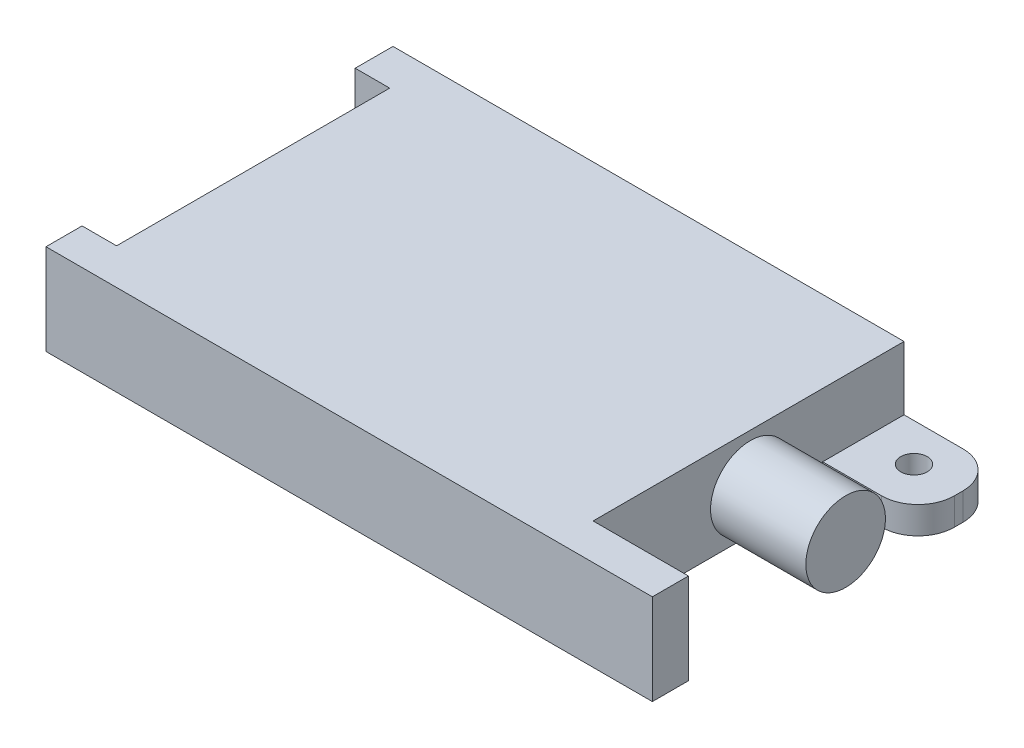
ISO-10303-21;
HEADER;
FILE_DESCRIPTION(('STEP AP214'),'2;1');
FILE_NAME('part.step','',(''),(''),'','','');
FILE_SCHEMA(('AUTOMOTIVE_DESIGN { 1 0 10303 214 1 1 1 1 }'));
ENDSEC;
DATA;
#1=APPLICATION_CONTEXT('core data for automotive mechanical design processes');
#2=APPLICATION_PROTOCOL_DEFINITION('international standard','automotive_design',2000,#1);
#3=PRODUCT_CONTEXT('',#1,'mechanical');
#4=PRODUCT('Part','Part','',(#3));
#5=PRODUCT_RELATED_PRODUCT_CATEGORY('part','',(#4));
#6=PRODUCT_DEFINITION_FORMATION('','',#4);
#7=PRODUCT_DEFINITION_CONTEXT('part definition',#1,'design');
#8=PRODUCT_DEFINITION('design','',#6,#7);
#9=PRODUCT_DEFINITION_SHAPE('','',#8);
#10=(LENGTH_UNIT() NAMED_UNIT(*) SI_UNIT(.MILLI.,.METRE.));
#11=(NAMED_UNIT(*) PLANE_ANGLE_UNIT() SI_UNIT($,.RADIAN.));
#12=(NAMED_UNIT(*) SI_UNIT($,.STERADIAN.) SOLID_ANGLE_UNIT());
#13=UNCERTAINTY_MEASURE_WITH_UNIT(LENGTH_MEASURE(1.E-05),#10,'distance_accuracy_value','');
#14=(GEOMETRIC_REPRESENTATION_CONTEXT(3) GLOBAL_UNCERTAINTY_ASSIGNED_CONTEXT((#13)) GLOBAL_UNIT_ASSIGNED_CONTEXT((#10,
#11,#12)) REPRESENTATION_CONTEXT('',''));
#15=CARTESIAN_POINT('',(0.,0.,0.));
#16=DIRECTION('',(0.,0.,1.));
#17=DIRECTION('',(1.,0.,0.));
#18=AXIS2_PLACEMENT_3D('',#15,#16,#17);
#19=CARTESIAN_POINT('',(51.4823576870266,20.,24.9824069411109));
#20=DIRECTION('',(-1.,0.,0.));
#21=DIRECTION('',(0.,0.,1.));
#22=AXIS2_PLACEMENT_3D('',#19,#20,#21);
#23=PLANE('',#22);
#24=DIRECTION('',(0.,-1.,0.));
#25=VECTOR('',#24,1.);
#26=CARTESIAN_POINT('',(51.4823576870266,20.,-43.5299514882993));
#27=LINE('',#26,#25);
#28=CARTESIAN_POINT('',(51.4823576870266,20.,-43.5299514882993));
#29=VERTEX_POINT('',#28);
#30=CARTESIAN_POINT('',(51.4823576870266,6.00000000000001,-43.5299514882993));
#31=VERTEX_POINT('',#30);
#32=EDGE_CURVE('E155',#29,#31,#27,.T.);
#33=ORIENTED_EDGE('',*,*,#32,.F.);
#34=DIRECTION('',(0.,0.,-1.));
#35=VECTOR('',#34,1.);
#36=CARTESIAN_POINT('',(51.4823576870266,20.,24.9824069411109));
#37=LINE('',#36,#35);
#38=CARTESIAN_POINT('',(51.4823576870266,20.,24.9824069411109));
#39=VERTEX_POINT('',#38);
#40=EDGE_CURVE('E141',#39,#29,#37,.T.);
#41=ORIENTED_EDGE('',*,*,#40,.F.);
#42=DIRECTION('',(0.,-1.,0.));
#43=VECTOR('',#42,1.);
#44=CARTESIAN_POINT('',(51.4823576870266,20.,24.9824069411109));
#45=LINE('',#44,#43);
#46=CARTESIAN_POINT('',(51.4823576870266,0.,24.9824069411109));
#47=VERTEX_POINT('',#46);
#48=EDGE_CURVE('E221',#39,#47,#45,.T.);
#49=ORIENTED_EDGE('',*,*,#48,.T.);
#50=DIRECTION('',(0.,0.,-1.));
#51=VECTOR('',#50,1.);
#52=CARTESIAN_POINT('',(51.4823576870266,0.,24.9824069411109));
#53=LINE('',#52,#51);
#54=CARTESIAN_POINT('',(51.4823576870266,0.,-25.6007158770618));
#55=VERTEX_POINT('',#54);
#56=EDGE_CURVE('E188',#47,#55,#53,.T.);
#57=ORIENTED_EDGE('',*,*,#56,.T.);
#58=DIRECTION('',(0.,-1.,0.));
#59=VECTOR('',#58,1.);
#60=CARTESIAN_POINT('',(51.4823576870266,20.,-25.6007158770618));
#61=LINE('',#60,#59);
#62=CARTESIAN_POINT('',(51.4823576870266,6.00000000000001,-25.6007158770618));
#63=VERTEX_POINT('',#62);
#64=EDGE_CURVE('E219',#63,#55,#61,.T.);
#65=ORIENTED_EDGE('',*,*,#64,.F.);
#66=DIRECTION('',(0.,0.,1.));
#67=VECTOR('',#66,1.);
#68=CARTESIAN_POINT('',(51.4823576870266,6.00000000000001,-21.0327198768425));
#69=LINE('',#68,#67);
#70=EDGE_CURVE('E158',#31,#63,#69,.T.);
#71=ORIENTED_EDGE('',*,*,#70,.F.);
#72=EDGE_LOOP('',(#33,#41,#49,#57,#65,#71));
#73=FACE_BOUND('',#72,.T.);
#74=CARTESIAN_POINT('',(51.4823576870266,9.24397515251485,-9.65602726427051));
#75=DIRECTION('',(-1.,0.,0.));
#76=DIRECTION('',(0.,0.,1.));
#77=AXIS2_PLACEMENT_3D('',#74,#75,#76);
#78=CIRCLE('',#77,8.76812544066752);
#79=CARTESIAN_POINT('',(51.4823576870266,9.24397515251485,-0.887901823602988));
#80=VERTEX_POINT('',#79);
#81=EDGE_CURVE('E11',#80,#80,#78,.F.);
#82=ORIENTED_EDGE('',*,*,#81,.F.);
#83=EDGE_LOOP('',(#82));
#84=FACE_BOUND('',#83,.T.);
#85=ADVANCED_FACE('F33',(#73,#84),#23,.F.);
#86=CARTESIAN_POINT('',(-61.1311927422638,20.,24.9824069411109));
#87=DIRECTION('',(1.,0.,0.));
#88=DIRECTION('',(0.,0.,-1.));
#89=AXIS2_PLACEMENT_3D('',#86,#87,#88);
#90=PLANE('',#89);
#91=DIRECTION('',(0.,0.,1.));
#92=VECTOR('',#91,1.);
#93=CARTESIAN_POINT('',(-61.1311927422638,0.,24.9824069411109));
#94=LINE('',#93,#92);
#95=CARTESIAN_POINT('',(-61.1311927422638,0.,24.9824069411109));
#96=VERTEX_POINT('',#95);
#97=CARTESIAN_POINT('',(-61.1311927422638,0.,32.9313546041917));
#98=VERTEX_POINT('',#97);
#99=EDGE_CURVE('E161',#96,#98,#94,.T.);
#100=ORIENTED_EDGE('',*,*,#99,.T.);
#101=DIRECTION('',(0.,-1.,0.));
#102=VECTOR('',#101,1.);
#103=CARTESIAN_POINT('',(-61.1311927422638,20.,32.9313546041917));
#104=LINE('',#103,#102);
#105=CARTESIAN_POINT('',(-61.1311927422638,20.,32.9313546041917));
#106=VERTEX_POINT('',#105);
#107=EDGE_CURVE('E229',#106,#98,#104,.T.);
#108=ORIENTED_EDGE('',*,*,#107,.F.);
#109=DIRECTION('',(0.,0.,1.));
#110=VECTOR('',#109,1.);
#111=CARTESIAN_POINT('',(-61.1311927422638,20.,24.9824069411109));
#112=LINE('',#111,#110);
#113=CARTESIAN_POINT('',(-61.1311927422638,20.,24.9824069411109));
#114=VERTEX_POINT('',#113);
#115=EDGE_CURVE('E206',#114,#106,#112,.T.);
#116=ORIENTED_EDGE('',*,*,#115,.F.);
#117=DIRECTION('',(0.,-1.,0.));
#118=VECTOR('',#117,1.);
#119=CARTESIAN_POINT('',(-61.1311927422638,20.,24.9824069411109));
#120=LINE('',#119,#118);
#121=EDGE_CURVE('E179',#114,#96,#120,.T.);
#122=ORIENTED_EDGE('',*,*,#121,.T.);
#123=EDGE_LOOP('',(#100,#108,#116,#122));
#124=FACE_BOUND('',#123,.T.);
#125=ADVANCED_FACE('F293',(#124),#90,.F.);
#126=CARTESIAN_POINT('',(-61.1311927422638,20.,32.9313546041917));
#127=DIRECTION('',(0.,0.,-1.));
#128=DIRECTION('',(-1.,0.,0.));
#129=AXIS2_PLACEMENT_3D('',#126,#127,#128);
#130=PLANE('',#129);
#131=DIRECTION('',(1.,0.,0.));
#132=VECTOR('',#131,1.);
#133=CARTESIAN_POINT('',(-61.1311927422638,0.,32.9313546041917));
#134=LINE('',#133,#132);
#135=CARTESIAN_POINT('',(72.4868322609506,0.,32.9313546041917));
#136=VERTEX_POINT('',#135);
#137=EDGE_CURVE('E182',#98,#136,#134,.T.);
#138=ORIENTED_EDGE('',*,*,#137,.T.);
#139=DIRECTION('',(0.,-1.,0.));
#140=VECTOR('',#139,1.);
#141=CARTESIAN_POINT('',(72.4868322609506,20.,32.9313546041917));
#142=LINE('',#141,#140);
#143=CARTESIAN_POINT('',(72.4868322609506,20.,32.9313546041917));
#144=VERTEX_POINT('',#143);
#145=EDGE_CURVE('E226',#144,#136,#142,.T.);
#146=ORIENTED_EDGE('',*,*,#145,.F.);
#147=DIRECTION('',(1.,0.,0.));
#148=VECTOR('',#147,1.);
#149=CARTESIAN_POINT('',(-61.1311927422638,20.,32.9313546041917));
#150=LINE('',#149,#148);
#151=EDGE_CURVE('E268',#106,#144,#150,.T.);
#152=ORIENTED_EDGE('',*,*,#151,.F.);
#153=ORIENTED_EDGE('',*,*,#107,.T.);
#154=EDGE_LOOP('',(#138,#146,#152,#153));
#155=FACE_BOUND('',#154,.T.);
#156=ADVANCED_FACE('F297',(#155),#130,.F.);
#157=CARTESIAN_POINT('',(72.4868322609506,20.,32.9313546041917));
#158=DIRECTION('',(-1.,0.,0.));
#159=DIRECTION('',(0.,0.,1.));
#160=AXIS2_PLACEMENT_3D('',#157,#158,#159);
#161=PLANE('',#160);
#162=DIRECTION('',(0.,0.,-1.));
#163=VECTOR('',#162,1.);
#164=CARTESIAN_POINT('',(72.4868322609506,0.,32.9313546041917));
#165=LINE('',#164,#163);
#166=CARTESIAN_POINT('',(72.4868322609506,0.,24.9824069411109));
#167=VERTEX_POINT('',#166);
#168=EDGE_CURVE('E184',#136,#167,#165,.T.);
#169=ORIENTED_EDGE('',*,*,#168,.T.);
#170=DIRECTION('',(0.,-1.,0.));
#171=VECTOR('',#170,1.);
#172=CARTESIAN_POINT('',(72.4868322609506,20.,24.9824069411109));
#173=LINE('',#172,#171);
#174=CARTESIAN_POINT('',(72.4868322609506,20.,24.9824069411109));
#175=VERTEX_POINT('',#174);
#176=EDGE_CURVE('E223',#175,#167,#173,.T.);
#177=ORIENTED_EDGE('',*,*,#176,.F.);
#178=DIRECTION('',(0.,0.,-1.));
#179=VECTOR('',#178,1.);
#180=CARTESIAN_POINT('',(72.4868322609506,20.,32.9313546041917));
#181=LINE('',#180,#179);
#182=EDGE_CURVE('E270',#144,#175,#181,.T.);
#183=ORIENTED_EDGE('',*,*,#182,.F.);
#184=ORIENTED_EDGE('',*,*,#145,.T.);
#185=EDGE_LOOP('',(#169,#177,#183,#184));
#186=FACE_BOUND('',#185,.T.);
#187=ADVANCED_FACE('F275',(#186),#161,.F.);
#188=CARTESIAN_POINT('',(72.4868322609506,20.,24.9824069411109));
#189=DIRECTION('',(0.,0.,1.));
#190=DIRECTION('',(1.,0.,0.));
#191=AXIS2_PLACEMENT_3D('',#188,#189,#190);
#192=PLANE('',#191);
#193=DIRECTION('',(-1.,0.,0.));
#194=VECTOR('',#193,1.);
#195=CARTESIAN_POINT('',(72.4868322609506,0.,24.9824069411109));
#196=LINE('',#195,#194);
#197=EDGE_CURVE('E186',#167,#47,#196,.T.);
#198=ORIENTED_EDGE('',*,*,#197,.T.);
#199=ORIENTED_EDGE('',*,*,#48,.F.);
#200=DIRECTION('',(-1.,0.,0.));
#201=VECTOR('',#200,1.);
#202=CARTESIAN_POINT('',(72.4868322609506,20.,24.9824069411109));
#203=LINE('',#202,#201);
#204=EDGE_CURVE('E148',#175,#39,#203,.T.);
#205=ORIENTED_EDGE('',*,*,#204,.F.);
#206=ORIENTED_EDGE('',*,*,#176,.T.);
#207=EDGE_LOOP('',(#198,#199,#205,#206));
#208=FACE_BOUND('',#207,.T.);
#209=ADVANCED_FACE('F279',(#208),#192,.F.);
#210=CARTESIAN_POINT('',(51.4823576870266,20.,-25.6007158770618));
#211=DIRECTION('',(0.,0.,-1.));
#212=DIRECTION('',(-1.,0.,0.));
#213=AXIS2_PLACEMENT_3D('',#210,#211,#212);
#214=PLANE('',#213);
#215=DIRECTION('',(0.,-1.,0.));
#216=VECTOR('',#215,1.);
#217=CARTESIAN_POINT('',(64.4868322609506,20.,-25.6007158770618));
#218=LINE('',#217,#216);
#219=CARTESIAN_POINT('',(64.4868322609506,0.,-25.6007158770618));
#220=VERTEX_POINT('',#219);
#221=CARTESIAN_POINT('',(64.4868322609506,6.00000000000001,-25.6007158770618));
#222=VERTEX_POINT('',#221);
#223=EDGE_CURVE('E242',#220,#222,#218,.F.);
#224=ORIENTED_EDGE('',*,*,#223,.T.);
#225=DIRECTION('',(-1.,0.,0.));
#226=VECTOR('',#225,1.);
#227=CARTESIAN_POINT('',(51.4823576870266,6.00000000000001,-25.6007158770618));
#228=LINE('',#227,#226);
#229=EDGE_CURVE('E48',#222,#63,#228,.T.);
#230=ORIENTED_EDGE('',*,*,#229,.T.);
#231=ORIENTED_EDGE('',*,*,#64,.T.);
#232=DIRECTION('',(1.,0.,0.));
#233=VECTOR('',#232,1.);
#234=CARTESIAN_POINT('',(51.4823576870266,0.,-25.6007158770618));
#235=LINE('',#234,#233);
#236=EDGE_CURVE('E191',#55,#220,#235,.T.);
#237=ORIENTED_EDGE('',*,*,#236,.T.);
#238=EDGE_LOOP('',(#224,#230,#231,#237));
#239=FACE_BOUND('',#238,.T.);
#240=ADVANCED_FACE('F282',(#239),#214,.F.);
#241=CARTESIAN_POINT('',(72.4868322609506,20.,-25.6007158770618));
#242=DIRECTION('',(-1.,0.,0.));
#243=DIRECTION('',(0.,0.,1.));
#244=AXIS2_PLACEMENT_3D('',#241,#242,#243);
#245=PLANE('',#244);
#246=DIRECTION('',(0.,-1.,0.));
#247=VECTOR('',#246,1.);
#248=CARTESIAN_POINT('',(72.4868322609506,20.,-35.5299514882993));
#249=LINE('',#248,#247);
#250=CARTESIAN_POINT('',(72.4868322609506,0.,-35.5299514882993));
#251=VERTEX_POINT('',#250);
#252=CARTESIAN_POINT('',(72.4868322609506,6.00000000000001,-35.5299514882993));
#253=VERTEX_POINT('',#252);
#254=EDGE_CURVE('E239',#251,#253,#249,.F.);
#255=ORIENTED_EDGE('',*,*,#254,.T.);
#256=DIRECTION('',(0.,0.,1.));
#257=VECTOR('',#256,1.);
#258=CARTESIAN_POINT('',(72.4868322609506,6.00000000000001,-25.6007158770618));
#259=LINE('',#258,#257);
#260=CARTESIAN_POINT('',(72.4868322609506,6.00000000000001,-33.6007158770619));
#261=VERTEX_POINT('',#260);
#262=EDGE_CURVE('E246',#253,#261,#259,.T.);
#263=ORIENTED_EDGE('',*,*,#262,.T.);
#264=DIRECTION('',(0.,-1.,0.));
#265=VECTOR('',#264,1.);
#266=CARTESIAN_POINT('',(72.4868322609506,20.,-33.6007158770619));
#267=LINE('',#266,#265);
#268=CARTESIAN_POINT('',(72.4868322609506,0.,-33.6007158770619));
#269=VERTEX_POINT('',#268);
#270=EDGE_CURVE('E237',#261,#269,#267,.T.);
#271=ORIENTED_EDGE('',*,*,#270,.T.);
#272=DIRECTION('',(0.,0.,-1.));
#273=VECTOR('',#272,1.);
#274=CARTESIAN_POINT('',(72.4868322609506,0.,-25.6007158770618));
#275=LINE('',#274,#273);
#276=EDGE_CURVE('E193',#269,#251,#275,.T.);
#277=ORIENTED_EDGE('',*,*,#276,.T.);
#278=EDGE_LOOP('',(#255,#263,#271,#277));
#279=FACE_BOUND('',#278,.T.);
#280=ADVANCED_FACE('F252',(#279),#245,.F.);
#281=CARTESIAN_POINT('',(72.4868322609506,20.,-43.5299514882993));
#282=DIRECTION('',(0.,0.,1.));
#283=DIRECTION('',(1.,0.,0.));
#284=AXIS2_PLACEMENT_3D('',#281,#282,#283);
#285=PLANE('',#284);
#286=DIRECTION('',(-1.,0.,0.));
#287=VECTOR('',#286,1.);
#288=CARTESIAN_POINT('',(72.4868322609506,20.,-43.5299514882993));
#289=LINE('',#288,#287);
#290=CARTESIAN_POINT('',(-61.1311927422638,20.,-43.5299514882993));
#291=VERTEX_POINT('',#290);
#292=EDGE_CURVE('E145',#29,#291,#289,.T.);
#293=ORIENTED_EDGE('',*,*,#292,.F.);
#294=ORIENTED_EDGE('',*,*,#32,.T.);
#295=DIRECTION('',(1.,0.,0.));
#296=VECTOR('',#295,1.);
#297=CARTESIAN_POINT('',(72.4868322609506,6.00000000000001,-43.5299514882993));
#298=LINE('',#297,#296);
#299=CARTESIAN_POINT('',(64.4868322609506,6.00000000000001,-43.5299514882993));
#300=VERTEX_POINT('',#299);
#301=EDGE_CURVE('E162',#31,#300,#298,.T.);
#302=ORIENTED_EDGE('',*,*,#301,.T.);
#303=DIRECTION('',(0.,-1.,0.));
#304=VECTOR('',#303,1.);
#305=CARTESIAN_POINT('',(64.4868322609506,20.,-43.5299514882993));
#306=LINE('',#305,#304);
#307=CARTESIAN_POINT('',(64.4868322609506,0.,-43.5299514882993));
#308=VERTEX_POINT('',#307);
#309=EDGE_CURVE('E232',#300,#308,#306,.T.);
#310=ORIENTED_EDGE('',*,*,#309,.T.);
#311=DIRECTION('',(-1.,0.,0.));
#312=VECTOR('',#311,1.);
#313=CARTESIAN_POINT('',(72.4868322609506,0.,-43.5299514882993));
#314=LINE('',#313,#312);
#315=CARTESIAN_POINT('',(-61.1311927422638,0.,-43.5299514882993));
#316=VERTEX_POINT('',#315);
#317=EDGE_CURVE('E196',#308,#316,#314,.T.);
#318=ORIENTED_EDGE('',*,*,#317,.T.);
#319=DIRECTION('',(0.,-1.,0.));
#320=VECTOR('',#319,1.);
#321=CARTESIAN_POINT('',(-61.1311927422638,20.,-43.5299514882993));
#322=LINE('',#321,#320);
#323=EDGE_CURVE('E166',#291,#316,#322,.T.);
#324=ORIENTED_EDGE('',*,*,#323,.F.);
#325=EDGE_LOOP('',(#293,#294,#302,#310,#318,#324));
#326=FACE_BOUND('',#325,.T.);
#327=ADVANCED_FACE('F164',(#326),#285,.F.);
#328=CARTESIAN_POINT('',(-61.1311927422638,20.,-43.5299514882993));
#329=DIRECTION('',(1.,0.,0.));
#330=DIRECTION('',(0.,0.,-1.));
#331=AXIS2_PLACEMENT_3D('',#328,#329,#330);
#332=PLANE('',#331);
#333=DIRECTION('',(0.,0.,1.));
#334=VECTOR('',#333,1.);
#335=CARTESIAN_POINT('',(-61.1311927422638,0.,-43.5299514882993));
#336=LINE('',#335,#334);
#337=CARTESIAN_POINT('',(-61.1311927422638,0.,-35.202482507929));
#338=VERTEX_POINT('',#337);
#339=EDGE_CURVE('E198',#316,#338,#336,.T.);
#340=ORIENTED_EDGE('',*,*,#339,.T.);
#341=DIRECTION('',(0.,-1.,0.));
#342=VECTOR('',#341,1.);
#343=CARTESIAN_POINT('',(-61.1311927422638,20.,-35.202482507929));
#344=LINE('',#343,#342);
#345=CARTESIAN_POINT('',(-61.1311927422638,20.,-35.202482507929));
#346=VERTEX_POINT('',#345);
#347=EDGE_CURVE('E215',#346,#338,#344,.T.);
#348=ORIENTED_EDGE('',*,*,#347,.F.);
#349=DIRECTION('',(0.,0.,1.));
#350=VECTOR('',#349,1.);
#351=CARTESIAN_POINT('',(-61.1311927422638,20.,-43.5299514882993));
#352=LINE('',#351,#350);
#353=EDGE_CURVE('E168',#291,#346,#352,.T.);
#354=ORIENTED_EDGE('',*,*,#353,.F.);
#355=ORIENTED_EDGE('',*,*,#323,.T.);
#356=EDGE_LOOP('',(#340,#348,#354,#355));
#357=FACE_BOUND('',#356,.T.);
#358=ADVANCED_FACE('F330',(#357),#332,.F.);
#359=CARTESIAN_POINT('',(-61.1311927422638,20.,-35.202482507929));
#360=DIRECTION('',(0.,0.,-1.));
#361=DIRECTION('',(-1.,0.,0.));
#362=AXIS2_PLACEMENT_3D('',#359,#360,#361);
#363=PLANE('',#362);
#364=DIRECTION('',(1.,0.,0.));
#365=VECTOR('',#364,1.);
#366=CARTESIAN_POINT('',(-61.1311927422638,0.,-35.202482507929));
#367=LINE('',#366,#365);
#368=CARTESIAN_POINT('',(-53.5291885304062,0.,-35.202482507929));
#369=VERTEX_POINT('',#368);
#370=EDGE_CURVE('E200',#338,#369,#367,.T.);
#371=ORIENTED_EDGE('',*,*,#370,.T.);
#372=DIRECTION('',(0.,-1.,0.));
#373=VECTOR('',#372,1.);
#374=CARTESIAN_POINT('',(-53.5291885304062,20.,-35.202482507929));
#375=LINE('',#374,#373);
#376=CARTESIAN_POINT('',(-53.5291885304062,20.,-35.202482507929));
#377=VERTEX_POINT('',#376);
#378=EDGE_CURVE('E212',#377,#369,#375,.T.);
#379=ORIENTED_EDGE('',*,*,#378,.F.);
#380=DIRECTION('',(1.,0.,0.));
#381=VECTOR('',#380,1.);
#382=CARTESIAN_POINT('',(-61.1311927422638,20.,-35.202482507929));
#383=LINE('',#382,#381);
#384=EDGE_CURVE('E170',#346,#377,#383,.T.);
#385=ORIENTED_EDGE('',*,*,#384,.F.);
#386=ORIENTED_EDGE('',*,*,#347,.T.);
#387=EDGE_LOOP('',(#371,#379,#385,#386));
#388=FACE_BOUND('',#387,.T.);
#389=ADVANCED_FACE('F326',(#388),#363,.F.);
#390=CARTESIAN_POINT('',(-53.5291885304062,20.,-35.202482507929));
#391=DIRECTION('',(1.,0.,0.));
#392=DIRECTION('',(0.,0.,-1.));
#393=AXIS2_PLACEMENT_3D('',#390,#391,#392);
#394=PLANE('',#393);
#395=DIRECTION('',(0.,0.,1.));
#396=VECTOR('',#395,1.);
#397=CARTESIAN_POINT('',(-53.5291885304062,0.,-35.202482507929));
#398=LINE('',#397,#396);
#399=CARTESIAN_POINT('',(-53.5291885304062,0.,24.9824069411109));
#400=VERTEX_POINT('',#399);
#401=EDGE_CURVE('E202',#369,#400,#398,.T.);
#402=ORIENTED_EDGE('',*,*,#401,.T.);
#403=DIRECTION('',(0.,-1.,0.));
#404=VECTOR('',#403,1.);
#405=CARTESIAN_POINT('',(-53.5291885304062,20.,24.9824069411109));
#406=LINE('',#405,#404);
#407=CARTESIAN_POINT('',(-53.5291885304062,20.,24.9824069411109));
#408=VERTEX_POINT('',#407);
#409=EDGE_CURVE('E209',#408,#400,#406,.T.);
#410=ORIENTED_EDGE('',*,*,#409,.F.);
#411=DIRECTION('',(0.,0.,1.));
#412=VECTOR('',#411,1.);
#413=CARTESIAN_POINT('',(-53.5291885304062,20.,-35.202482507929));
#414=LINE('',#413,#412);
#415=EDGE_CURVE('E175',#377,#408,#414,.T.);
#416=ORIENTED_EDGE('',*,*,#415,.F.);
#417=ORIENTED_EDGE('',*,*,#378,.T.);
#418=EDGE_LOOP('',(#402,#410,#416,#417));
#419=FACE_BOUND('',#418,.T.);
#420=ADVANCED_FACE('F322',(#419),#394,.F.);
#421=CARTESIAN_POINT('',(-53.5291885304062,20.,24.9824069411109));
#422=DIRECTION('',(0.,0.,1.));
#423=DIRECTION('',(1.,0.,0.));
#424=AXIS2_PLACEMENT_3D('',#421,#422,#423);
#425=PLANE('',#424);
#426=DIRECTION('',(-1.,0.,0.));
#427=VECTOR('',#426,1.);
#428=CARTESIAN_POINT('',(-53.5291885304062,0.,24.9824069411109));
#429=LINE('',#428,#427);
#430=EDGE_CURVE('E204',#400,#96,#429,.T.);
#431=ORIENTED_EDGE('',*,*,#430,.T.);
#432=ORIENTED_EDGE('',*,*,#121,.F.);
#433=DIRECTION('',(-1.,0.,0.));
#434=VECTOR('',#433,1.);
#435=CARTESIAN_POINT('',(-53.5291885304062,20.,24.9824069411109));
#436=LINE('',#435,#434);
#437=EDGE_CURVE('E177',#408,#114,#436,.T.);
#438=ORIENTED_EDGE('',*,*,#437,.F.);
#439=ORIENTED_EDGE('',*,*,#409,.T.);
#440=EDGE_LOOP('',(#431,#432,#438,#439));
#441=FACE_BOUND('',#440,.T.);
#442=ADVANCED_FACE('F315',(#441),#425,.F.);
#443=CARTESIAN_POINT('',(0.,20.,0.));
#444=DIRECTION('',(0.,1.,0.));
#445=DIRECTION('',(0.,0.,1.));
#446=AXIS2_PLACEMENT_3D('',#443,#444,#445);
#447=PLANE('',#446);
#448=ORIENTED_EDGE('',*,*,#40,.T.);
#449=ORIENTED_EDGE('',*,*,#292,.T.);
#450=ORIENTED_EDGE('',*,*,#353,.T.);
#451=ORIENTED_EDGE('',*,*,#384,.T.);
#452=ORIENTED_EDGE('',*,*,#415,.T.);
#453=ORIENTED_EDGE('',*,*,#437,.T.);
#454=ORIENTED_EDGE('',*,*,#115,.T.);
#455=ORIENTED_EDGE('',*,*,#151,.T.);
#456=ORIENTED_EDGE('',*,*,#182,.T.);
#457=ORIENTED_EDGE('',*,*,#204,.T.);
#458=EDGE_LOOP('',(#448,#449,#450,#451,#452,#453,#454,#455,#456,#457));
#459=FACE_BOUND('',#458,.T.);
#460=ADVANCED_FACE('F143',(#459),#447,.T.);
#461=CARTESIAN_POINT('',(0.,0.,0.));
#462=DIRECTION('',(0.,1.,0.));
#463=DIRECTION('',(0.,0.,1.));
#464=AXIS2_PLACEMENT_3D('',#461,#462,#463);
#465=PLANE('',#464);
#466=CARTESIAN_POINT('',(62.0102386238841,0.,-35.1951301300346));
#467=DIRECTION('',(0.,1.,0.));
#468=DIRECTION('',(0.,0.,1.));
#469=AXIS2_PLACEMENT_3D('',#466,#467,#468);
#470=CIRCLE('',#469,2.92024248801681);
#471=CARTESIAN_POINT('',(62.0102386238841,0.,-32.2748876420178));
#472=VERTEX_POINT('',#471);
#473=EDGE_CURVE('E428',#472,#472,#470,.T.);
#474=ORIENTED_EDGE('',*,*,#473,.T.);
#475=EDGE_LOOP('',(#474));
#476=FACE_BOUND('',#475,.T.);
#477=ORIENTED_EDGE('',*,*,#317,.F.);
#478=CARTESIAN_POINT('',(64.4868322609506,0.,-35.5299514882993));
#479=DIRECTION('',(0.,1.,0.));
#480=DIRECTION('',(0.,0.,1.));
#481=AXIS2_PLACEMENT_3D('',#478,#479,#480);
#482=CIRCLE('',#481,8.);
#483=EDGE_CURVE('E235',#308,#251,#482,.F.);
#484=ORIENTED_EDGE('',*,*,#483,.T.);
#485=ORIENTED_EDGE('',*,*,#276,.F.);
#486=CARTESIAN_POINT('',(64.4868322609506,0.,-33.6007158770619));
#487=DIRECTION('',(0.,1.,0.));
#488=DIRECTION('',(0.,0.,1.));
#489=AXIS2_PLACEMENT_3D('',#486,#487,#488);
#490=CIRCLE('',#489,8.);
#491=EDGE_CURVE('E56',#269,#220,#490,.F.);
#492=ORIENTED_EDGE('',*,*,#491,.T.);
#493=ORIENTED_EDGE('',*,*,#236,.F.);
#494=ORIENTED_EDGE('',*,*,#56,.F.);
#495=ORIENTED_EDGE('',*,*,#197,.F.);
#496=ORIENTED_EDGE('',*,*,#168,.F.);
#497=ORIENTED_EDGE('',*,*,#137,.F.);
#498=ORIENTED_EDGE('',*,*,#99,.F.);
#499=ORIENTED_EDGE('',*,*,#430,.F.);
#500=ORIENTED_EDGE('',*,*,#401,.F.);
#501=ORIENTED_EDGE('',*,*,#370,.F.);
#502=ORIENTED_EDGE('',*,*,#339,.F.);
#503=EDGE_LOOP('',(#477,#484,#485,#492,#493,#494,#495,#496,#497,#498,#499,#500,#501,#502));
#504=FACE_BOUND('',#503,.T.);
#505=ADVANCED_FACE('F256',(#476,#504),#465,.F.);
#506=CARTESIAN_POINT('',(64.4868322609506,20.,-35.5299514882993));
#507=DIRECTION('',(0.,-1.,0.));
#508=DIRECTION('',(0.,0.,-1.));
#509=AXIS2_PLACEMENT_3D('',#506,#507,#508);
#510=CYLINDRICAL_SURFACE('',#509,8.);
#511=CARTESIAN_POINT('',(64.4868322609506,6.00000000000001,-35.5299514882993));
#512=DIRECTION('',(0.,-1.,0.));
#513=DIRECTION('',(0.,0.,-1.));
#514=AXIS2_PLACEMENT_3D('',#511,#512,#513);
#515=CIRCLE('',#514,8.);
#516=EDGE_CURVE('E261',#253,#300,#515,.F.);
#517=ORIENTED_EDGE('',*,*,#516,.F.);
#518=ORIENTED_EDGE('',*,*,#254,.F.);
#519=ORIENTED_EDGE('',*,*,#483,.F.);
#520=ORIENTED_EDGE('',*,*,#309,.F.);
#521=EDGE_LOOP('',(#517,#518,#519,#520));
#522=FACE_BOUND('',#521,.T.);
#523=ADVANCED_FACE('F259',(#522),#510,.T.);
#524=CARTESIAN_POINT('',(64.4868322609506,20.,-33.6007158770619));
#525=DIRECTION('',(0.,-1.,0.));
#526=DIRECTION('',(0.,0.,-1.));
#527=AXIS2_PLACEMENT_3D('',#524,#525,#526);
#528=CYLINDRICAL_SURFACE('',#527,8.);
#529=CARTESIAN_POINT('',(64.4868322609506,6.00000000000001,-33.6007158770619));
#530=DIRECTION('',(0.,-1.,0.));
#531=DIRECTION('',(0.,0.,-1.));
#532=AXIS2_PLACEMENT_3D('',#529,#530,#531);
#533=CIRCLE('',#532,8.);
#534=EDGE_CURVE('E41',#222,#261,#533,.F.);
#535=ORIENTED_EDGE('',*,*,#534,.F.);
#536=ORIENTED_EDGE('',*,*,#223,.F.);
#537=ORIENTED_EDGE('',*,*,#491,.F.);
#538=ORIENTED_EDGE('',*,*,#270,.F.);
#539=EDGE_LOOP('',(#535,#536,#537,#538));
#540=FACE_BOUND('',#539,.T.);
#541=ADVANCED_FACE('F35',(#540),#528,.T.);
#542=CARTESIAN_POINT('',(0.,6.00000000000001,0.));
#543=DIRECTION('',(0.,-1.,0.));
#544=DIRECTION('',(0.,0.,-1.));
#545=AXIS2_PLACEMENT_3D('',#542,#543,#544);
#546=PLANE('',#545);
#547=CARTESIAN_POINT('',(62.0102386238841,6.00000000000001,-35.1951301300346));
#548=DIRECTION('',(0.,1.,0.));
#549=DIRECTION('',(0.,0.,1.));
#550=AXIS2_PLACEMENT_3D('',#547,#548,#549);
#551=CIRCLE('',#550,2.92024248801681);
#552=CARTESIAN_POINT('',(62.0102386238841,6.00000000000001,-32.2748876420178));
#553=VERTEX_POINT('',#552);
#554=EDGE_CURVE('E425',#553,#553,#551,.T.);
#555=ORIENTED_EDGE('',*,*,#554,.F.);
#556=EDGE_LOOP('',(#555));
#557=FACE_BOUND('',#556,.T.);
#558=ORIENTED_EDGE('',*,*,#70,.T.);
#559=ORIENTED_EDGE('',*,*,#229,.F.);
#560=ORIENTED_EDGE('',*,*,#534,.T.);
#561=ORIENTED_EDGE('',*,*,#262,.F.);
#562=ORIENTED_EDGE('',*,*,#516,.T.);
#563=ORIENTED_EDGE('',*,*,#301,.F.);
#564=EDGE_LOOP('',(#558,#559,#560,#561,#562,#563));
#565=FACE_BOUND('',#564,.T.);
#566=ADVANCED_FACE('F245',(#557,#565),#546,.F.);
#567=CARTESIAN_POINT('',(62.0102386238841,0.,-35.1951301300346));
#568=DIRECTION('',(0.,1.,0.));
#569=DIRECTION('',(0.,0.,1.));
#570=AXIS2_PLACEMENT_3D('',#567,#568,#569);
#571=CYLINDRICAL_SURFACE('',#570,2.92024248801681);
#572=ORIENTED_EDGE('',*,*,#473,.F.);
#573=EDGE_LOOP('',(#572));
#574=FACE_BOUND('',#573,.T.);
#575=ORIENTED_EDGE('',*,*,#554,.T.);
#576=EDGE_LOOP('',(#575));
#577=FACE_BOUND('',#576,.T.);
#578=ADVANCED_FACE('F384',(#574,#577),#571,.F.);
#579=CARTESIAN_POINT('',(97.2868360905118,9.24397515251485,-9.65602726427051));
#580=DIRECTION('',(-1.,0.,0.));
#581=DIRECTION('',(0.,0.,1.));
#582=AXIS2_PLACEMENT_3D('',#579,#580,#581);
#583=CYLINDRICAL_SURFACE('',#582,8.76812544066752);
#584=CARTESIAN_POINT('',(72.4868322609506,9.24397515251485,-9.65602726427051));
#585=DIRECTION('',(-1.,0.,0.));
#586=DIRECTION('',(0.,0.,1.));
#587=AXIS2_PLACEMENT_3D('',#584,#585,#586);
#588=CIRCLE('',#587,8.76812544066752);
#589=CARTESIAN_POINT('',(72.4868322609506,9.24397515251485,-0.887901823602988));
#590=VERTEX_POINT('',#589);
#591=EDGE_CURVE('E424',#590,#590,#588,.T.);
#592=ORIENTED_EDGE('',*,*,#591,.T.);
#593=EDGE_LOOP('',(#592));
#594=FACE_BOUND('',#593,.T.);
#595=ORIENTED_EDGE('',*,*,#81,.T.);
#596=EDGE_LOOP('',(#595));
#597=FACE_BOUND('',#596,.T.);
#598=ADVANCED_FACE('F392',(#594,#597),#583,.T.);
#599=CARTESIAN_POINT('',(72.4868322609506,20.,32.9313546041917));
#600=DIRECTION('',(-1.,0.,0.));
#601=DIRECTION('',(0.,0.,1.));
#602=AXIS2_PLACEMENT_3D('',#599,#600,#601);
#603=PLANE('',#602);
#604=ORIENTED_EDGE('',*,*,#591,.F.);
#605=EDGE_LOOP('',(#604));
#606=FACE_BOUND('',#605,.T.);
#607=ADVANCED_FACE('F408',(#606),#603,.F.);
#608=CLOSED_SHELL('',(#85,#125,#156,#187,#209,#240,#280,#327,#358,#389,#420,#442,#460,#505,#523,
#541,#566,#578,#598,#607));
#609=MANIFOLD_SOLID_BREP('B2',#608);
#610=ADVANCED_BREP_SHAPE_REPRESENTATION('',(#18,#609),#14);
#611=SHAPE_DEFINITION_REPRESENTATION(#9,#610);
ENDSEC;
END-ISO-10303-21;
